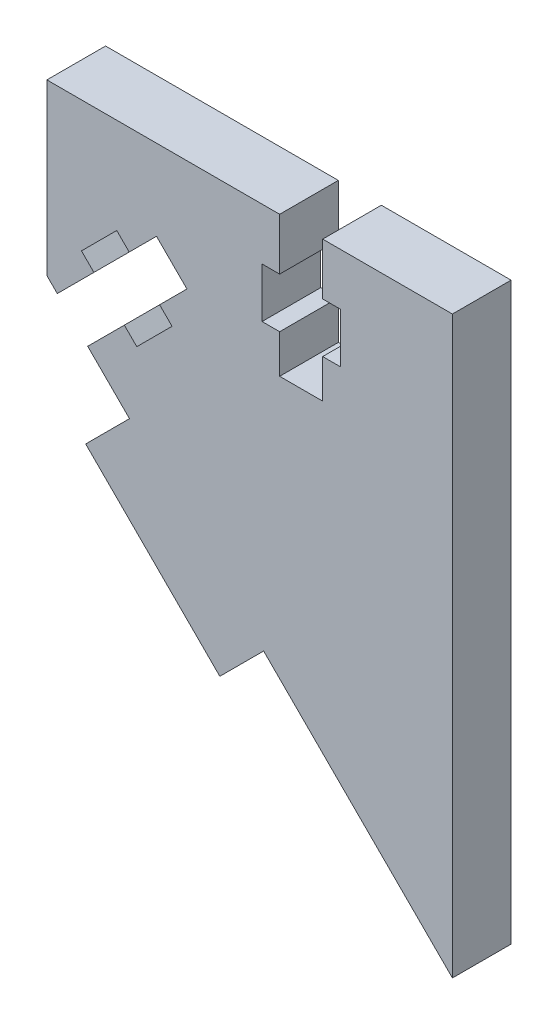
ISO-10303-21;
HEADER;
FILE_DESCRIPTION(('STEP AP214'),'2;1');
FILE_NAME('part.step','',(''),(''),'','','');
FILE_SCHEMA(('AUTOMOTIVE_DESIGN { 1 0 10303 214 1 1 1 1 }'));
ENDSEC;
DATA;
#1=APPLICATION_CONTEXT('core data for automotive mechanical design processes');
#2=APPLICATION_PROTOCOL_DEFINITION('international standard','automotive_design',2000,#1);
#3=PRODUCT_CONTEXT('',#1,'mechanical');
#4=PRODUCT('Part','Part','',(#3));
#5=PRODUCT_RELATED_PRODUCT_CATEGORY('part','',(#4));
#6=PRODUCT_DEFINITION_FORMATION('','',#4);
#7=PRODUCT_DEFINITION_CONTEXT('part definition',#1,'design');
#8=PRODUCT_DEFINITION('design','',#6,#7);
#9=PRODUCT_DEFINITION_SHAPE('','',#8);
#10=(LENGTH_UNIT() NAMED_UNIT(*) SI_UNIT(.MILLI.,.METRE.));
#11=(NAMED_UNIT(*) PLANE_ANGLE_UNIT() SI_UNIT($,.RADIAN.));
#12=(NAMED_UNIT(*) SI_UNIT($,.STERADIAN.) SOLID_ANGLE_UNIT());
#13=UNCERTAINTY_MEASURE_WITH_UNIT(LENGTH_MEASURE(1.E-05),#10,'distance_accuracy_value','');
#14=(GEOMETRIC_REPRESENTATION_CONTEXT(3) GLOBAL_UNCERTAINTY_ASSIGNED_CONTEXT((#13)) GLOBAL_UNIT_ASSIGNED_CONTEXT((#10,
#11,#12)) REPRESENTATION_CONTEXT('',''));
#15=CARTESIAN_POINT('',(0.,0.,0.));
#16=DIRECTION('',(0.,0.,1.));
#17=DIRECTION('',(1.,0.,0.));
#18=AXIS2_PLACEMENT_3D('',#15,#16,#17);
#19=CARTESIAN_POINT('',(37.2899171233436,57.7322805717091,6.));
#20=DIRECTION('',(0.707106781186467,0.707106781186629,0.));
#21=DIRECTION('',(-0.707106781186629,0.707106781186467,0.));
#22=AXIS2_PLACEMENT_3D('',#19,#20,#21);
#23=PLANE('',#22);
#24=DIRECTION('',(0.707106781186628,-0.707106781186467,0.));
#25=VECTOR('',#24,1.);
#26=CARTESIAN_POINT('',(37.2899171233436,57.7322805717091,0.));
#27=LINE('',#26,#25);
#28=CARTESIAN_POINT('',(37.2899171233436,57.7322805717091,0.));
#29=VERTEX_POINT('',#28);
#30=CARTESIAN_POINT('',(38.5627079774212,56.4594897176318,0.));
#31=VERTEX_POINT('',#30);
#32=EDGE_CURVE('E278',#29,#31,#27,.T.);
#33=ORIENTED_EDGE('',*,*,#32,.T.);
#34=DIRECTION('',(0.,0.,-1.));
#35=VECTOR('',#34,1.);
#36=CARTESIAN_POINT('',(38.5627079774212,56.4594897176318,6.));
#37=LINE('',#36,#35);
#38=CARTESIAN_POINT('',(38.5627079774212,56.4594897176318,6.));
#39=VERTEX_POINT('',#38);
#40=EDGE_CURVE('E11',#39,#31,#37,.T.);
#41=ORIENTED_EDGE('',*,*,#40,.F.);
#42=DIRECTION('',(0.707106781186628,-0.707106781186467,0.));
#43=VECTOR('',#42,1.);
#44=CARTESIAN_POINT('',(37.2899171233436,57.7322805717091,6.));
#45=LINE('',#44,#43);
#46=CARTESIAN_POINT('',(37.2899171233436,57.7322805717091,6.));
#47=VERTEX_POINT('',#46);
#48=EDGE_CURVE('E340',#47,#39,#45,.T.);
#49=ORIENTED_EDGE('',*,*,#48,.F.);
#50=DIRECTION('',(0.,0.,-1.));
#51=VECTOR('',#50,1.);
#52=CARTESIAN_POINT('',(37.2899171233436,57.7322805717091,6.));
#53=LINE('',#52,#51);
#54=EDGE_CURVE('E274',#47,#29,#53,.T.);
#55=ORIENTED_EDGE('',*,*,#54,.T.);
#56=EDGE_LOOP('',(#33,#41,#49,#55));
#57=FACE_BOUND('',#56,.T.);
#58=ADVANCED_FACE('F38',(#57),#23,.F.);
#59=CARTESIAN_POINT('',(38.5627079774212,56.4594897176318,6.));
#60=DIRECTION('',(-0.707106781186467,0.707106781186628,0.));
#61=DIRECTION('',(-0.707106781186628,-0.707106781186467,0.));
#62=AXIS2_PLACEMENT_3D('',#59,#60,#61);
#63=PLANE('',#62);
#64=DIRECTION('',(0.707106781186628,0.707106781186467,0.));
#65=VECTOR('',#64,1.);
#66=CARTESIAN_POINT('',(38.5627079774212,56.4594897176318,0.));
#67=LINE('',#66,#65);
#68=CARTESIAN_POINT('',(41.3557794140099,59.2525611542199,0.));
#69=VERTEX_POINT('',#68);
#70=EDGE_CURVE('E281',#31,#69,#67,.T.);
#71=ORIENTED_EDGE('',*,*,#70,.T.);
#72=DIRECTION('',(0.,0.,-1.));
#73=VECTOR('',#72,1.);
#74=CARTESIAN_POINT('',(41.3557794140099,59.2525611542199,6.));
#75=LINE('',#74,#73);
#76=CARTESIAN_POINT('',(41.3557794140099,59.2525611542199,6.));
#77=VERTEX_POINT('',#76);
#78=EDGE_CURVE('E46',#77,#69,#75,.T.);
#79=ORIENTED_EDGE('',*,*,#78,.F.);
#80=DIRECTION('',(0.707106781186628,0.707106781186467,0.));
#81=VECTOR('',#80,1.);
#82=CARTESIAN_POINT('',(38.5627079774212,56.4594897176318,6.));
#83=LINE('',#82,#81);
#84=EDGE_CURVE('E169',#39,#77,#83,.T.);
#85=ORIENTED_EDGE('',*,*,#84,.F.);
#86=ORIENTED_EDGE('',*,*,#40,.T.);
#87=EDGE_LOOP('',(#71,#79,#85,#86));
#88=FACE_BOUND('',#87,.T.);
#89=ADVANCED_FACE('F518',(#88),#63,.F.);
#90=CARTESIAN_POINT('',(41.3557794140099,59.2525611542199,6.));
#91=DIRECTION('',(0.707106781186548,0.707106781186547,0.));
#92=DIRECTION('',(-0.707106781186547,0.707106781186548,0.));
#93=AXIS2_PLACEMENT_3D('',#90,#91,#92);
#94=PLANE('',#93);
#95=DIRECTION('',(0.707106781186547,-0.707106781186548,0.));
#96=VECTOR('',#95,1.);
#97=CARTESIAN_POINT('',(41.3557794140099,59.2525611542199,0.));
#98=LINE('',#97,#96);
#99=CARTESIAN_POINT('',(44.467052305718,56.1412882625117,0.));
#100=VERTEX_POINT('',#99);
#101=EDGE_CURVE('E283',#69,#100,#98,.T.);
#102=ORIENTED_EDGE('',*,*,#101,.T.);
#103=DIRECTION('',(0.,0.,-1.));
#104=VECTOR('',#103,1.);
#105=CARTESIAN_POINT('',(44.467052305718,56.1412882625117,6.));
#106=LINE('',#105,#104);
#107=CARTESIAN_POINT('',(44.467052305718,56.1412882625117,6.));
#108=VERTEX_POINT('',#107);
#109=EDGE_CURVE('E419',#108,#100,#106,.T.);
#110=ORIENTED_EDGE('',*,*,#109,.F.);
#111=DIRECTION('',(0.707106781186547,-0.707106781186548,0.));
#112=VECTOR('',#111,1.);
#113=CARTESIAN_POINT('',(41.3557794140099,59.2525611542199,6.));
#114=LINE('',#113,#112);
#115=EDGE_CURVE('E427',#77,#108,#114,.T.);
#116=ORIENTED_EDGE('',*,*,#115,.F.);
#117=ORIENTED_EDGE('',*,*,#78,.T.);
#118=EDGE_LOOP('',(#102,#110,#116,#117));
#119=FACE_BOUND('',#118,.T.);
#120=ADVANCED_FACE('F425',(#119),#94,.F.);
#121=CARTESIAN_POINT('',(44.467052305718,56.1412882625117,6.));
#122=DIRECTION('',(0.707106781186547,-0.707106781186547,0.));
#123=DIRECTION('',(0.707106781186548,0.707106781186548,0.));
#124=AXIS2_PLACEMENT_3D('',#121,#122,#123);
#125=PLANE('',#124);
#126=DIRECTION('',(-0.707106781186548,-0.707106781186548,0.));
#127=VECTOR('',#126,1.);
#128=CARTESIAN_POINT('',(44.467052305718,56.1412882625117,0.));
#129=LINE('',#128,#127);
#130=CARTESIAN_POINT('',(41.6739808691298,53.3482168259235,0.));
#131=VERTEX_POINT('',#130);
#132=EDGE_CURVE('E285',#100,#131,#129,.T.);
#133=ORIENTED_EDGE('',*,*,#132,.T.);
#134=DIRECTION('',(0.,0.,-1.));
#135=VECTOR('',#134,1.);
#136=CARTESIAN_POINT('',(41.6739808691298,53.3482168259235,6.));
#137=LINE('',#136,#135);
#138=CARTESIAN_POINT('',(41.6739808691298,53.3482168259235,6.));
#139=VERTEX_POINT('',#138);
#140=EDGE_CURVE('E416',#139,#131,#137,.T.);
#141=ORIENTED_EDGE('',*,*,#140,.F.);
#142=DIRECTION('',(-0.707106781186548,-0.707106781186548,0.));
#143=VECTOR('',#142,1.);
#144=CARTESIAN_POINT('',(44.467052305718,56.1412882625117,6.));
#145=LINE('',#144,#143);
#146=EDGE_CURVE('E445',#108,#139,#145,.T.);
#147=ORIENTED_EDGE('',*,*,#146,.F.);
#148=ORIENTED_EDGE('',*,*,#109,.T.);
#149=EDGE_LOOP('',(#133,#141,#147,#148));
#150=FACE_BOUND('',#149,.T.);
#151=ADVANCED_FACE('F436',(#150),#125,.F.);
#152=CARTESIAN_POINT('',(41.6739808691298,53.3482168259235,6.));
#153=DIRECTION('',(0.707106781186615,0.70710678118648,0.));
#154=DIRECTION('',(-0.70710678118648,0.707106781186615,0.));
#155=AXIS2_PLACEMENT_3D('',#152,#153,#154);
#156=PLANE('',#155);
#157=DIRECTION('',(0.70710678118648,-0.707106781186615,0.));
#158=VECTOR('',#157,1.);
#159=CARTESIAN_POINT('',(41.6739808691298,53.3482168259235,0.));
#160=LINE('',#159,#158);
#161=CARTESIAN_POINT('',(42.9467717232073,52.0754259718458,0.));
#162=VERTEX_POINT('',#161);
#163=EDGE_CURVE('E287',#131,#162,#160,.T.);
#164=ORIENTED_EDGE('',*,*,#163,.T.);
#165=DIRECTION('',(0.,0.,-1.));
#166=VECTOR('',#165,1.);
#167=CARTESIAN_POINT('',(42.9467717232073,52.0754259718458,6.));
#168=LINE('',#167,#166);
#169=CARTESIAN_POINT('',(42.9467717232073,52.0754259718458,6.));
#170=VERTEX_POINT('',#169);
#171=EDGE_CURVE('E413',#170,#162,#168,.T.);
#172=ORIENTED_EDGE('',*,*,#171,.F.);
#173=DIRECTION('',(0.70710678118648,-0.707106781186615,0.));
#174=VECTOR('',#173,1.);
#175=CARTESIAN_POINT('',(41.6739808691298,53.3482168259235,6.));
#176=LINE('',#175,#174);
#177=EDGE_CURVE('E442',#139,#170,#176,.T.);
#178=ORIENTED_EDGE('',*,*,#177,.F.);
#179=ORIENTED_EDGE('',*,*,#140,.T.);
#180=EDGE_LOOP('',(#164,#172,#178,#179));
#181=FACE_BOUND('',#180,.T.);
#182=ADVANCED_FACE('F440',(#181),#156,.F.);
#183=CARTESIAN_POINT('',(42.9467717232073,52.0754259718458,6.));
#184=DIRECTION('',(0.707106781186519,-0.707106781186575,0.));
#185=DIRECTION('',(0.707106781186575,0.707106781186519,0.));
#186=AXIS2_PLACEMENT_3D('',#183,#184,#185);
#187=PLANE('',#186);
#188=DIRECTION('',(-0.707106781186575,-0.70710678118652,0.));
#189=VECTOR('',#188,1.);
#190=CARTESIAN_POINT('',(42.9467717232073,52.0754259718458,0.));
#191=LINE('',#190,#189);
#192=CARTESIAN_POINT('',(39.3405290083921,48.4691832570309,0.));
#193=VERTEX_POINT('',#192);
#194=EDGE_CURVE('E289',#162,#193,#191,.T.);
#195=ORIENTED_EDGE('',*,*,#194,.T.);
#196=DIRECTION('',(0.,0.,-1.));
#197=VECTOR('',#196,1.);
#198=CARTESIAN_POINT('',(39.3405290083921,48.4691832570309,6.));
#199=LINE('',#198,#197);
#200=CARTESIAN_POINT('',(39.3405290083921,48.4691832570309,6.));
#201=VERTEX_POINT('',#200);
#202=EDGE_CURVE('E410',#201,#193,#199,.T.);
#203=ORIENTED_EDGE('',*,*,#202,.F.);
#204=DIRECTION('',(-0.707106781186575,-0.70710678118652,0.));
#205=VECTOR('',#204,1.);
#206=CARTESIAN_POINT('',(42.9467717232073,52.0754259718458,6.));
#207=LINE('',#206,#205);
#208=EDGE_CURVE('E444',#170,#201,#207,.T.);
#209=ORIENTED_EDGE('',*,*,#208,.F.);
#210=ORIENTED_EDGE('',*,*,#171,.T.);
#211=EDGE_LOOP('',(#195,#203,#209,#210));
#212=FACE_BOUND('',#211,.T.);
#213=ADVANCED_FACE('F531',(#212),#187,.F.);
#214=CARTESIAN_POINT('',(39.3405290083921,48.4691832570309,6.));
#215=DIRECTION('',(-0.7071067811866,-0.707106781186496,0.));
#216=DIRECTION('',(0.707106781186496,-0.7071067811866,0.));
#217=AXIS2_PLACEMENT_3D('',#214,#215,#216);
#218=PLANE('',#217);
#219=DIRECTION('',(-0.707106781186495,0.7071067811866,0.));
#220=VECTOR('',#219,1.);
#221=CARTESIAN_POINT('',(39.3405290083921,48.4691832570309,0.));
#222=LINE('',#221,#220);
#223=CARTESIAN_POINT('',(38.0677381543152,49.741974111108,0.));
#224=VERTEX_POINT('',#223);
#225=EDGE_CURVE('E291',#193,#224,#222,.T.);
#226=ORIENTED_EDGE('',*,*,#225,.T.);
#227=DIRECTION('',(0.,0.,-1.));
#228=VECTOR('',#227,1.);
#229=CARTESIAN_POINT('',(38.0677381543152,49.741974111108,6.));
#230=LINE('',#229,#228);
#231=CARTESIAN_POINT('',(38.0677381543152,49.741974111108,6.));
#232=VERTEX_POINT('',#231);
#233=EDGE_CURVE('E407',#232,#224,#230,.T.);
#234=ORIENTED_EDGE('',*,*,#233,.F.);
#235=DIRECTION('',(-0.707106781186495,0.7071067811866,0.));
#236=VECTOR('',#235,1.);
#237=CARTESIAN_POINT('',(39.3405290083921,48.4691832570309,6.));
#238=LINE('',#237,#236);
#239=EDGE_CURVE('E447',#201,#232,#238,.T.);
#240=ORIENTED_EDGE('',*,*,#239,.F.);
#241=ORIENTED_EDGE('',*,*,#202,.T.);
#242=EDGE_LOOP('',(#226,#234,#240,#241));
#243=FACE_BOUND('',#242,.T.);
#244=ADVANCED_FACE('F534',(#243),#218,.F.);
#245=CARTESIAN_POINT('',(38.0677381543152,49.741974111108,6.));
#246=DIRECTION('',(0.707106781186469,-0.707106781186626,0.));
#247=DIRECTION('',(0.707106781186626,0.707106781186469,0.));
#248=AXIS2_PLACEMENT_3D('',#245,#246,#247);
#249=PLANE('',#248);
#250=DIRECTION('',(-0.707106781186626,-0.707106781186469,0.));
#251=VECTOR('',#250,1.);
#252=CARTESIAN_POINT('',(38.0677381543152,49.741974111108,0.));
#253=LINE('',#252,#251);
#254=CARTESIAN_POINT('',(34.3200733469527,45.9943093037463,0.));
#255=VERTEX_POINT('',#254);
#256=EDGE_CURVE('E293',#224,#255,#253,.T.);
#257=ORIENTED_EDGE('',*,*,#256,.T.);
#258=DIRECTION('',(0.,0.,-1.));
#259=VECTOR('',#258,1.);
#260=CARTESIAN_POINT('',(34.3200733469527,45.9943093037463,6.));
#261=LINE('',#260,#259);
#262=CARTESIAN_POINT('',(34.3200733469527,45.9943093037463,6.));
#263=VERTEX_POINT('',#262);
#264=EDGE_CURVE('E404',#263,#255,#261,.T.);
#265=ORIENTED_EDGE('',*,*,#264,.F.);
#266=DIRECTION('',(-0.707106781186626,-0.707106781186469,0.));
#267=VECTOR('',#266,1.);
#268=CARTESIAN_POINT('',(38.0677381543152,49.741974111108,6.));
#269=LINE('',#268,#267);
#270=EDGE_CURVE('E453',#232,#263,#269,.T.);
#271=ORIENTED_EDGE('',*,*,#270,.F.);
#272=ORIENTED_EDGE('',*,*,#233,.T.);
#273=EDGE_LOOP('',(#257,#265,#271,#272));
#274=FACE_BOUND('',#273,.T.);
#275=ADVANCED_FACE('F538',(#274),#249,.F.);
#276=CARTESIAN_POINT('',(38.5931592389421,41.721223411756,6.));
#277=DIRECTION('',(0.707106781186616,0.707106781186479,0.));
#278=DIRECTION('',(-0.707106781186479,0.707106781186616,0.));
#279=AXIS2_PLACEMENT_3D('',#276,#277,#278);
#280=PLANE('',#279);
#281=DIRECTION('',(0.707106781186479,-0.707106781186616,0.));
#282=VECTOR('',#281,1.);
#283=CARTESIAN_POINT('',(38.5931592389421,41.721223411756,0.));
#284=LINE('',#283,#282);
#285=CARTESIAN_POINT('',(38.5931592389421,41.721223411756,0.));
#286=VERTEX_POINT('',#285);
#287=EDGE_CURVE('E295',#255,#286,#284,.T.);
#288=ORIENTED_EDGE('',*,*,#287,.T.);
#289=DIRECTION('',(0.,0.,-1.));
#290=VECTOR('',#289,1.);
#291=CARTESIAN_POINT('',(38.5931592389421,41.721223411756,6.));
#292=LINE('',#291,#290);
#293=CARTESIAN_POINT('',(38.5931592389421,41.721223411756,6.));
#294=VERTEX_POINT('',#293);
#295=EDGE_CURVE('E401',#294,#286,#292,.T.);
#296=ORIENTED_EDGE('',*,*,#295,.F.);
#297=DIRECTION('',(0.707106781186479,-0.707106781186616,0.));
#298=VECTOR('',#297,1.);
#299=CARTESIAN_POINT('',(38.5931592389421,41.721223411756,6.));
#300=LINE('',#299,#298);
#301=EDGE_CURVE('E455',#263,#294,#300,.T.);
#302=ORIENTED_EDGE('',*,*,#301,.F.);
#303=ORIENTED_EDGE('',*,*,#264,.T.);
#304=EDGE_LOOP('',(#288,#296,#302,#303));
#305=FACE_BOUND('',#304,.T.);
#306=ADVANCED_FACE('F542',(#305),#280,.F.);
#307=CARTESIAN_POINT('',(38.5931592389421,41.721223411756,6.));
#308=DIRECTION('',(0.707106781186554,-0.707106781186541,0.));
#309=DIRECTION('',(0.707106781186541,0.707106781186554,0.));
#310=AXIS2_PLACEMENT_3D('',#307,#308,#309);
#311=PLANE('',#310);
#312=DIRECTION('',(-0.707106781186541,-0.707106781186554,0.));
#313=VECTOR('',#312,1.);
#314=CARTESIAN_POINT('',(38.5931592389421,41.721223411756,0.));
#315=LINE('',#314,#313);
#316=CARTESIAN_POINT('',(34.1127995526525,37.2408637254663,0.));
#317=VERTEX_POINT('',#316);
#318=EDGE_CURVE('E297',#286,#317,#315,.T.);
#319=ORIENTED_EDGE('',*,*,#318,.T.);
#320=DIRECTION('',(0.,0.,-1.));
#321=VECTOR('',#320,1.);
#322=CARTESIAN_POINT('',(34.1127995526525,37.2408637254663,6.));
#323=LINE('',#322,#321);
#324=CARTESIAN_POINT('',(34.1127995526525,37.2408637254663,6.));
#325=VERTEX_POINT('',#324);
#326=EDGE_CURVE('E398',#325,#317,#323,.T.);
#327=ORIENTED_EDGE('',*,*,#326,.F.);
#328=DIRECTION('',(-0.707106781186541,-0.707106781186554,0.));
#329=VECTOR('',#328,1.);
#330=CARTESIAN_POINT('',(38.5931592389421,41.721223411756,6.));
#331=LINE('',#330,#329);
#332=EDGE_CURVE('E457',#294,#325,#331,.T.);
#333=ORIENTED_EDGE('',*,*,#332,.F.);
#334=ORIENTED_EDGE('',*,*,#295,.T.);
#335=EDGE_LOOP('',(#319,#327,#333,#334));
#336=FACE_BOUND('',#335,.T.);
#337=ADVANCED_FACE('F546',(#336),#311,.F.);
#338=CARTESIAN_POINT('',(34.1127995526525,37.2408637254663,6.));
#339=DIRECTION('',(0.707106781186563,0.707106781186532,0.));
#340=DIRECTION('',(-0.707106781186532,0.707106781186563,0.));
#341=AXIS2_PLACEMENT_3D('',#338,#339,#340);
#342=PLANE('',#341);
#343=DIRECTION('',(0.707106781186532,-0.707106781186563,0.));
#344=VECTOR('',#343,1.);
#345=CARTESIAN_POINT('',(34.1127995526525,37.2408637254663,0.));
#346=LINE('',#345,#344);
#347=CARTESIAN_POINT('',(47.8306670666276,23.5229962114907,0.));
#348=VERTEX_POINT('',#347);
#349=EDGE_CURVE('E299',#317,#348,#346,.T.);
#350=ORIENTED_EDGE('',*,*,#349,.T.);
#351=DIRECTION('',(0.,0.,-1.));
#352=VECTOR('',#351,1.);
#353=CARTESIAN_POINT('',(47.8306670666276,23.5229962114907,6.));
#354=LINE('',#353,#352);
#355=CARTESIAN_POINT('',(47.8306670666276,23.5229962114907,6.));
#356=VERTEX_POINT('',#355);
#357=EDGE_CURVE('E395',#356,#348,#354,.T.);
#358=ORIENTED_EDGE('',*,*,#357,.F.);
#359=DIRECTION('',(0.707106781186532,-0.707106781186563,0.));
#360=VECTOR('',#359,1.);
#361=CARTESIAN_POINT('',(34.1127995526525,37.2408637254663,6.));
#362=LINE('',#361,#360);
#363=EDGE_CURVE('E459',#325,#356,#362,.T.);
#364=ORIENTED_EDGE('',*,*,#363,.F.);
#365=ORIENTED_EDGE('',*,*,#326,.T.);
#366=EDGE_LOOP('',(#350,#358,#364,#365));
#367=FACE_BOUND('',#366,.T.);
#368=ADVANCED_FACE('F550',(#367),#342,.F.);
#369=CARTESIAN_POINT('',(47.8306670666276,23.5229962114907,6.));
#370=DIRECTION('',(-0.707106781186588,0.707106781186507,0.));
#371=DIRECTION('',(-0.707106781186507,-0.707106781186588,0.));
#372=AXIS2_PLACEMENT_3D('',#369,#370,#371);
#373=PLANE('',#372);
#374=DIRECTION('',(0.707106781186507,0.707106781186588,0.));
#375=VECTOR('',#374,1.);
#376=CARTESIAN_POINT('',(47.8306670666276,23.5229962114907,0.));
#377=LINE('',#376,#375);
#378=CARTESIAN_POINT('',(52.3110267529176,28.0033558977812,0.));
#379=VERTEX_POINT('',#378);
#380=EDGE_CURVE('E301',#348,#379,#377,.T.);
#381=ORIENTED_EDGE('',*,*,#380,.T.);
#382=DIRECTION('',(0.,0.,-1.));
#383=VECTOR('',#382,1.);
#384=CARTESIAN_POINT('',(52.3110267529176,28.0033558977812,6.));
#385=LINE('',#384,#383);
#386=CARTESIAN_POINT('',(52.3110267529176,28.0033558977812,6.));
#387=VERTEX_POINT('',#386);
#388=EDGE_CURVE('E392',#387,#379,#385,.T.);
#389=ORIENTED_EDGE('',*,*,#388,.F.);
#390=DIRECTION('',(0.707106781186507,0.707106781186588,0.));
#391=VECTOR('',#390,1.);
#392=CARTESIAN_POINT('',(47.8306670666276,23.5229962114907,6.));
#393=LINE('',#392,#391);
#394=EDGE_CURVE('E461',#356,#387,#393,.T.);
#395=ORIENTED_EDGE('',*,*,#394,.F.);
#396=ORIENTED_EDGE('',*,*,#357,.T.);
#397=EDGE_LOOP('',(#381,#389,#395,#396));
#398=FACE_BOUND('',#397,.T.);
#399=ADVANCED_FACE('F554',(#398),#373,.F.);
#400=CARTESIAN_POINT('',(71.6150418067965,8.69934084390166,6.));
#401=DIRECTION('',(0.70710678118656,0.707106781186535,0.));
#402=DIRECTION('',(-0.707106781186535,0.70710678118656,0.));
#403=AXIS2_PLACEMENT_3D('',#400,#401,#402);
#404=PLANE('',#403);
#405=DIRECTION('',(0.707106781186535,-0.70710678118656,0.));
#406=VECTOR('',#405,1.);
#407=CARTESIAN_POINT('',(71.6150418067965,8.69934084390166,0.));
#408=LINE('',#407,#406);
#409=CARTESIAN_POINT('',(71.6150418067965,8.69934084390166,0.));
#410=VERTEX_POINT('',#409);
#411=EDGE_CURVE('E303',#379,#410,#408,.T.);
#412=ORIENTED_EDGE('',*,*,#411,.T.);
#413=DIRECTION('',(0.,0.,-1.));
#414=VECTOR('',#413,1.);
#415=CARTESIAN_POINT('',(71.6150418067965,8.69934084390166,6.));
#416=LINE('',#415,#414);
#417=CARTESIAN_POINT('',(71.6150418067965,8.69934084390166,6.));
#418=VERTEX_POINT('',#417);
#419=EDGE_CURVE('E389',#418,#410,#416,.T.);
#420=ORIENTED_EDGE('',*,*,#419,.F.);
#421=DIRECTION('',(0.707106781186535,-0.70710678118656,0.));
#422=VECTOR('',#421,1.);
#423=CARTESIAN_POINT('',(71.6150418067965,8.69934084390166,6.));
#424=LINE('',#423,#422);
#425=EDGE_CURVE('E463',#387,#418,#424,.T.);
#426=ORIENTED_EDGE('',*,*,#425,.F.);
#427=ORIENTED_EDGE('',*,*,#388,.T.);
#428=EDGE_LOOP('',(#412,#420,#426,#427));
#429=FACE_BOUND('',#428,.T.);
#430=ADVANCED_FACE('F558',(#429),#404,.F.);
#431=CARTESIAN_POINT('',(71.6150418067964,67.499336139902,6.));
#432=DIRECTION('',(-1.,0.,0.));
#433=DIRECTION('',(0.,-1.,0.));
#434=AXIS2_PLACEMENT_3D('',#431,#432,#433);
#435=PLANE('',#434);
#436=DIRECTION('',(0.,1.,0.));
#437=VECTOR('',#436,1.);
#438=CARTESIAN_POINT('',(71.6150418067964,67.499336139902,0.));
#439=LINE('',#438,#437);
#440=CARTESIAN_POINT('',(71.6150418067964,67.499336139902,0.));
#441=VERTEX_POINT('',#440);
#442=EDGE_CURVE('E305',#410,#441,#439,.T.);
#443=ORIENTED_EDGE('',*,*,#442,.T.);
#444=DIRECTION('',(0.,0.,-1.));
#445=VECTOR('',#444,1.);
#446=CARTESIAN_POINT('',(71.6150418067964,67.499336139902,6.));
#447=LINE('',#446,#445);
#448=CARTESIAN_POINT('',(71.6150418067964,67.499336139902,6.));
#449=VERTEX_POINT('',#448);
#450=EDGE_CURVE('E386',#449,#441,#447,.T.);
#451=ORIENTED_EDGE('',*,*,#450,.F.);
#452=DIRECTION('',(0.,1.,0.));
#453=VECTOR('',#452,1.);
#454=CARTESIAN_POINT('',(71.6150418067964,67.499336139902,6.));
#455=LINE('',#454,#453);
#456=EDGE_CURVE('E465',#418,#449,#455,.T.);
#457=ORIENTED_EDGE('',*,*,#456,.F.);
#458=ORIENTED_EDGE('',*,*,#419,.T.);
#459=EDGE_LOOP('',(#443,#451,#457,#458));
#460=FACE_BOUND('',#459,.T.);
#461=ADVANCED_FACE('F562',(#460),#435,.F.);
#462=CARTESIAN_POINT('',(71.6150418067964,67.499336139902,6.));
#463=DIRECTION('',(-3.23228183936215E-13,-1.,0.));
#464=DIRECTION('',(1.,-3.23228183936215E-13,0.));
#465=AXIS2_PLACEMENT_3D('',#462,#463,#464);
#466=PLANE('',#465);
#467=DIRECTION('',(-1.,3.23228183936215E-13,0.));
#468=VECTOR('',#467,1.);
#469=CARTESIAN_POINT('',(71.6150418067964,67.499336139902,0.));
#470=LINE('',#469,#468);
#471=CARTESIAN_POINT('',(58.3481404481547,67.4993361399063,0.));
#472=VERTEX_POINT('',#471);
#473=EDGE_CURVE('E307',#441,#472,#470,.T.);
#474=ORIENTED_EDGE('',*,*,#473,.T.);
#475=DIRECTION('',(0.,0.,-1.));
#476=VECTOR('',#475,1.);
#477=CARTESIAN_POINT('',(58.3481404481547,67.4993361399063,6.));
#478=LINE('',#477,#476);
#479=CARTESIAN_POINT('',(58.3481404481547,67.4993361399063,6.));
#480=VERTEX_POINT('',#479);
#481=EDGE_CURVE('E383',#480,#472,#478,.T.);
#482=ORIENTED_EDGE('',*,*,#481,.F.);
#483=DIRECTION('',(-1.,3.23228183936215E-13,0.));
#484=VECTOR('',#483,1.);
#485=CARTESIAN_POINT('',(71.6150418067964,67.499336139902,6.));
#486=LINE('',#485,#484);
#487=EDGE_CURVE('E467',#449,#480,#486,.T.);
#488=ORIENTED_EDGE('',*,*,#487,.F.);
#489=ORIENTED_EDGE('',*,*,#450,.T.);
#490=EDGE_LOOP('',(#474,#482,#488,#489));
#491=FACE_BOUND('',#490,.T.);
#492=ADVANCED_FACE('F566',(#491),#466,.F.);
#493=CARTESIAN_POINT('',(58.3481404481547,67.4993361399063,6.));
#494=DIRECTION('',(1.,8.11719909615041E-13,0.));
#495=DIRECTION('',(-8.11719909615041E-13,1.,0.));
#496=AXIS2_PLACEMENT_3D('',#493,#494,#495);
#497=PLANE('',#496);
#498=DIRECTION('',(8.11719909615041E-13,-1.,0.));
#499=VECTOR('',#498,1.);
#500=CARTESIAN_POINT('',(58.3481404481547,67.4993361399063,0.));
#501=LINE('',#500,#499);
#502=CARTESIAN_POINT('',(58.348140448159,62.1993377421058,0.));
#503=VERTEX_POINT('',#502);
#504=EDGE_CURVE('E309',#472,#503,#501,.T.);
#505=ORIENTED_EDGE('',*,*,#504,.T.);
#506=DIRECTION('',(0.,0.,-1.));
#507=VECTOR('',#506,1.);
#508=CARTESIAN_POINT('',(58.348140448159,62.1993377421058,6.));
#509=LINE('',#508,#507);
#510=CARTESIAN_POINT('',(58.348140448159,62.1993377421058,6.));
#511=VERTEX_POINT('',#510);
#512=EDGE_CURVE('E380',#511,#503,#509,.T.);
#513=ORIENTED_EDGE('',*,*,#512,.F.);
#514=DIRECTION('',(8.11719909615041E-13,-1.,0.));
#515=VECTOR('',#514,1.);
#516=CARTESIAN_POINT('',(58.3481404481547,67.4993361399063,6.));
#517=LINE('',#516,#515);
#518=EDGE_CURVE('E469',#480,#511,#517,.T.);
#519=ORIENTED_EDGE('',*,*,#518,.F.);
#520=ORIENTED_EDGE('',*,*,#481,.T.);
#521=EDGE_LOOP('',(#505,#513,#519,#520));
#522=FACE_BOUND('',#521,.T.);
#523=ADVANCED_FACE('F570',(#522),#497,.F.);
#524=CARTESIAN_POINT('',(58.348140448159,62.1993377421058,6.));
#525=DIRECTION('',(-5.97516498675732E-13,1.,0.));
#526=DIRECTION('',(-1.,-5.97516498675732E-13,0.));
#527=AXIS2_PLACEMENT_3D('',#524,#525,#526);
#528=PLANE('',#527);
#529=DIRECTION('',(1.,5.97516498675732E-13,0.));
#530=VECTOR('',#529,1.);
#531=CARTESIAN_POINT('',(58.348140448159,62.1993377421058,0.));
#532=LINE('',#531,#530);
#533=CARTESIAN_POINT('',(60.14813853606,62.1993377421069,0.));
#534=VERTEX_POINT('',#533);
#535=EDGE_CURVE('E311',#503,#534,#532,.T.);
#536=ORIENTED_EDGE('',*,*,#535,.T.);
#537=DIRECTION('',(0.,0.,-1.));
#538=VECTOR('',#537,1.);
#539=CARTESIAN_POINT('',(60.14813853606,62.1993377421069,6.));
#540=LINE('',#539,#538);
#541=CARTESIAN_POINT('',(60.14813853606,62.1993377421069,6.));
#542=VERTEX_POINT('',#541);
#543=EDGE_CURVE('E377',#542,#534,#540,.T.);
#544=ORIENTED_EDGE('',*,*,#543,.F.);
#545=DIRECTION('',(1.,5.97516498675732E-13,0.));
#546=VECTOR('',#545,1.);
#547=CARTESIAN_POINT('',(58.348140448159,62.1993377421058,6.));
#548=LINE('',#547,#546);
#549=EDGE_CURVE('E471',#511,#542,#548,.T.);
#550=ORIENTED_EDGE('',*,*,#549,.F.);
#551=ORIENTED_EDGE('',*,*,#512,.T.);
#552=EDGE_LOOP('',(#536,#544,#550,#551));
#553=FACE_BOUND('',#552,.T.);
#554=ADVANCED_FACE('F574',(#553),#528,.F.);
#555=CARTESIAN_POINT('',(60.14813853606,62.1993377421069,6.));
#556=DIRECTION('',(1.,7.65999861337384E-13,0.));
#557=DIRECTION('',(-7.65999861337384E-13,1.,0.));
#558=AXIS2_PLACEMENT_3D('',#555,#556,#557);
#559=PLANE('',#558);
#560=DIRECTION('',(7.65999861337384E-13,-1.,0.));
#561=VECTOR('',#560,1.);
#562=CARTESIAN_POINT('',(60.14813853606,62.1993377421069,0.));
#563=LINE('',#562,#561);
#564=CARTESIAN_POINT('',(60.1481385360639,57.0993403856072,0.));
#565=VERTEX_POINT('',#564);
#566=EDGE_CURVE('E313',#534,#565,#563,.T.);
#567=ORIENTED_EDGE('',*,*,#566,.T.);
#568=DIRECTION('',(0.,0.,-1.));
#569=VECTOR('',#568,1.);
#570=CARTESIAN_POINT('',(60.1481385360639,57.0993403856072,6.));
#571=LINE('',#570,#569);
#572=CARTESIAN_POINT('',(60.1481385360639,57.0993403856072,6.));
#573=VERTEX_POINT('',#572);
#574=EDGE_CURVE('E374',#573,#565,#571,.T.);
#575=ORIENTED_EDGE('',*,*,#574,.F.);
#576=DIRECTION('',(7.65999861337384E-13,-1.,0.));
#577=VECTOR('',#576,1.);
#578=CARTESIAN_POINT('',(60.14813853606,62.1993377421069,6.));
#579=LINE('',#578,#577);
#580=EDGE_CURVE('E473',#542,#573,#579,.T.);
#581=ORIENTED_EDGE('',*,*,#580,.F.);
#582=ORIENTED_EDGE('',*,*,#543,.T.);
#583=EDGE_LOOP('',(#567,#575,#581,#582));
#584=FACE_BOUND('',#583,.T.);
#585=ADVANCED_FACE('F578',(#584),#559,.F.);
#586=CARTESIAN_POINT('',(60.1481385360639,57.0993403856072,6.));
#587=DIRECTION('',(9.67591233339568E-13,-1.,0.));
#588=DIRECTION('',(1.,9.67591233339568E-13,0.));
#589=AXIS2_PLACEMENT_3D('',#586,#587,#588);
#590=PLANE('',#589);
#591=DIRECTION('',(-1.,-9.67591233339568E-13,0.));
#592=VECTOR('',#591,1.);
#593=CARTESIAN_POINT('',(60.1481385360639,57.0993403856072,0.));
#594=LINE('',#593,#592);
#595=CARTESIAN_POINT('',(58.3481404481632,57.0993403856055,0.));
#596=VERTEX_POINT('',#595);
#597=EDGE_CURVE('E315',#565,#596,#594,.T.);
#598=ORIENTED_EDGE('',*,*,#597,.T.);
#599=DIRECTION('',(0.,0.,-1.));
#600=VECTOR('',#599,1.);
#601=CARTESIAN_POINT('',(58.3481404481632,57.0993403856055,6.));
#602=LINE('',#601,#600);
#603=CARTESIAN_POINT('',(58.3481404481632,57.0993403856055,6.));
#604=VERTEX_POINT('',#603);
#605=EDGE_CURVE('E371',#604,#596,#602,.T.);
#606=ORIENTED_EDGE('',*,*,#605,.F.);
#607=DIRECTION('',(-1.,-9.67591233339568E-13,0.));
#608=VECTOR('',#607,1.);
#609=CARTESIAN_POINT('',(60.1481385360639,57.0993403856072,6.));
#610=LINE('',#609,#608);
#611=EDGE_CURVE('E475',#573,#604,#610,.T.);
#612=ORIENTED_EDGE('',*,*,#611,.F.);
#613=ORIENTED_EDGE('',*,*,#574,.T.);
#614=EDGE_LOOP('',(#598,#606,#612,#613));
#615=FACE_BOUND('',#614,.T.);
#616=ADVANCED_FACE('F582',(#615),#590,.F.);
#617=CARTESIAN_POINT('',(58.3481404481632,57.0993403856055,6.));
#618=DIRECTION('',(1.,7.37806532631935E-13,0.));
#619=DIRECTION('',(-7.37806532631935E-13,1.,0.));
#620=AXIS2_PLACEMENT_3D('',#617,#618,#619);
#621=PLANE('',#620);
#622=DIRECTION('',(7.37806532631935E-13,-1.,0.));
#623=VECTOR('',#622,1.);
#624=CARTESIAN_POINT('',(58.3481404481632,57.0993403856055,0.));
#625=LINE('',#624,#623);
#626=CARTESIAN_POINT('',(58.3481404481661,53.1493408793055,0.));
#627=VERTEX_POINT('',#626);
#628=EDGE_CURVE('E317',#596,#627,#625,.T.);
#629=ORIENTED_EDGE('',*,*,#628,.T.);
#630=DIRECTION('',(0.,0.,-1.));
#631=VECTOR('',#630,1.);
#632=CARTESIAN_POINT('',(58.3481404481661,53.1493408793055,6.));
#633=LINE('',#632,#631);
#634=CARTESIAN_POINT('',(58.3481404481661,53.1493408793055,6.));
#635=VERTEX_POINT('',#634);
#636=EDGE_CURVE('E368',#635,#627,#633,.T.);
#637=ORIENTED_EDGE('',*,*,#636,.F.);
#638=DIRECTION('',(7.37806532631935E-13,-1.,0.));
#639=VECTOR('',#638,1.);
#640=CARTESIAN_POINT('',(58.3481404481632,57.0993403856055,6.));
#641=LINE('',#640,#639);
#642=EDGE_CURVE('E477',#604,#635,#641,.T.);
#643=ORIENTED_EDGE('',*,*,#642,.F.);
#644=ORIENTED_EDGE('',*,*,#605,.T.);
#645=EDGE_LOOP('',(#629,#637,#643,#644));
#646=FACE_BOUND('',#645,.T.);
#647=ADVANCED_FACE('F586',(#646),#621,.F.);
#648=CARTESIAN_POINT('',(58.3481404481661,53.1493408793055,6.));
#649=DIRECTION('',(8.5947578748955E-13,-1.,0.));
#650=DIRECTION('',(1.,8.5947578748955E-13,0.));
#651=AXIS2_PLACEMENT_3D('',#648,#649,#650);
#652=PLANE('',#651);
#653=DIRECTION('',(-1.,-8.5947578748955E-13,0.));
#654=VECTOR('',#653,1.);
#655=CARTESIAN_POINT('',(58.3481404481661,53.1493408793055,0.));
#656=LINE('',#655,#654);
#657=CARTESIAN_POINT('',(53.9481361284686,53.1493408793017,0.));
#658=VERTEX_POINT('',#657);
#659=EDGE_CURVE('E319',#627,#658,#656,.T.);
#660=ORIENTED_EDGE('',*,*,#659,.T.);
#661=DIRECTION('',(0.,0.,-1.));
#662=VECTOR('',#661,1.);
#663=CARTESIAN_POINT('',(53.9481361284686,53.1493408793017,6.));
#664=LINE('',#663,#662);
#665=CARTESIAN_POINT('',(53.9481361284686,53.1493408793017,6.));
#666=VERTEX_POINT('',#665);
#667=EDGE_CURVE('E365',#666,#658,#664,.T.);
#668=ORIENTED_EDGE('',*,*,#667,.F.);
#669=DIRECTION('',(-1.,-8.5947578748955E-13,0.));
#670=VECTOR('',#669,1.);
#671=CARTESIAN_POINT('',(58.3481404481661,53.1493408793055,6.));
#672=LINE('',#671,#670);
#673=EDGE_CURVE('E479',#635,#666,#672,.T.);
#674=ORIENTED_EDGE('',*,*,#673,.F.);
#675=ORIENTED_EDGE('',*,*,#636,.T.);
#676=EDGE_LOOP('',(#660,#668,#674,#675));
#677=FACE_BOUND('',#676,.T.);
#678=ADVANCED_FACE('F590',(#677),#652,.F.);
#679=CARTESIAN_POINT('',(53.9481361284686,53.1493408793017,6.));
#680=DIRECTION('',(-1.,-8.36180736982816E-13,0.));
#681=DIRECTION('',(8.36180736982816E-13,-1.,0.));
#682=AXIS2_PLACEMENT_3D('',#679,#680,#681);
#683=PLANE('',#682);
#684=DIRECTION('',(-8.36180736982816E-13,1.,0.));
#685=VECTOR('',#684,1.);
#686=CARTESIAN_POINT('',(53.9481361284686,53.1493408793017,0.));
#687=LINE('',#686,#685);
#688=CARTESIAN_POINT('',(53.9481361284653,57.0993403856019,0.));
#689=VERTEX_POINT('',#688);
#690=EDGE_CURVE('E321',#658,#689,#687,.T.);
#691=ORIENTED_EDGE('',*,*,#690,.T.);
#692=DIRECTION('',(0.,0.,-1.));
#693=VECTOR('',#692,1.);
#694=CARTESIAN_POINT('',(53.9481361284653,57.0993403856019,6.));
#695=LINE('',#694,#693);
#696=CARTESIAN_POINT('',(53.9481361284653,57.0993403856019,6.));
#697=VERTEX_POINT('',#696);
#698=EDGE_CURVE('E362',#697,#689,#695,.T.);
#699=ORIENTED_EDGE('',*,*,#698,.F.);
#700=DIRECTION('',(-8.36180736982816E-13,1.,0.));
#701=VECTOR('',#700,1.);
#702=CARTESIAN_POINT('',(53.9481361284686,53.1493408793017,6.));
#703=LINE('',#702,#701);
#704=EDGE_CURVE('E481',#666,#697,#703,.T.);
#705=ORIENTED_EDGE('',*,*,#704,.F.);
#706=ORIENTED_EDGE('',*,*,#667,.T.);
#707=EDGE_LOOP('',(#691,#699,#705,#706));
#708=FACE_BOUND('',#707,.T.);
#709=ADVANCED_FACE('F594',(#708),#683,.F.);
#710=CARTESIAN_POINT('',(53.9481361284653,57.0993403856019,6.));
#711=DIRECTION('',(7.09309908105309E-13,-1.,0.));
#712=DIRECTION('',(1.,7.09309908105309E-13,0.));
#713=AXIS2_PLACEMENT_3D('',#710,#711,#712);
#714=PLANE('',#713);
#715=DIRECTION('',(-1.,-7.09309908105309E-13,0.));
#716=VECTOR('',#715,1.);
#717=CARTESIAN_POINT('',(53.9481361284653,57.0993403856019,0.));
#718=LINE('',#717,#716);
#719=CARTESIAN_POINT('',(52.1481380405641,57.0993403856006,0.));
#720=VERTEX_POINT('',#719);
#721=EDGE_CURVE('E323',#689,#720,#718,.T.);
#722=ORIENTED_EDGE('',*,*,#721,.T.);
#723=DIRECTION('',(0.,0.,-1.));
#724=VECTOR('',#723,1.);
#725=CARTESIAN_POINT('',(52.1481380405641,57.0993403856006,6.));
#726=LINE('',#725,#724);
#727=CARTESIAN_POINT('',(52.1481380405641,57.0993403856006,6.));
#728=VERTEX_POINT('',#727);
#729=EDGE_CURVE('E359',#728,#720,#726,.T.);
#730=ORIENTED_EDGE('',*,*,#729,.F.);
#731=DIRECTION('',(-1.,-7.09309908105309E-13,0.));
#732=VECTOR('',#731,1.);
#733=CARTESIAN_POINT('',(53.9481361284653,57.0993403856019,6.));
#734=LINE('',#733,#732);
#735=EDGE_CURVE('E483',#697,#728,#734,.T.);
#736=ORIENTED_EDGE('',*,*,#735,.F.);
#737=ORIENTED_EDGE('',*,*,#698,.T.);
#738=EDGE_LOOP('',(#722,#730,#736,#737));
#739=FACE_BOUND('',#738,.T.);
#740=ADVANCED_FACE('F598',(#739),#714,.F.);
#741=CARTESIAN_POINT('',(52.1481380405641,57.0993403856006,6.));
#742=DIRECTION('',(-1.,-6.87086909370011E-13,0.));
#743=DIRECTION('',(6.87086909370011E-13,-1.,0.));
#744=AXIS2_PLACEMENT_3D('',#741,#742,#743);
#745=PLANE('',#744);
#746=DIRECTION('',(-6.87086909370011E-13,1.,0.));
#747=VECTOR('',#746,1.);
#748=CARTESIAN_POINT('',(52.1481380405641,57.0993403856006,0.));
#749=LINE('',#748,#747);
#750=CARTESIAN_POINT('',(52.1481380405606,62.1993377421011,0.));
#751=VERTEX_POINT('',#750);
#752=EDGE_CURVE('E325',#720,#751,#749,.T.);
#753=ORIENTED_EDGE('',*,*,#752,.T.);
#754=DIRECTION('',(0.,0.,-1.));
#755=VECTOR('',#754,1.);
#756=CARTESIAN_POINT('',(52.1481380405606,62.1993377421011,6.));
#757=LINE('',#756,#755);
#758=CARTESIAN_POINT('',(52.1481380405606,62.1993377421011,6.));
#759=VERTEX_POINT('',#758);
#760=EDGE_CURVE('E356',#759,#751,#757,.T.);
#761=ORIENTED_EDGE('',*,*,#760,.F.);
#762=DIRECTION('',(-6.87086909370011E-13,1.,0.));
#763=VECTOR('',#762,1.);
#764=CARTESIAN_POINT('',(52.1481380405641,57.0993403856006,6.));
#765=LINE('',#764,#763);
#766=EDGE_CURVE('E485',#728,#759,#765,.T.);
#767=ORIENTED_EDGE('',*,*,#766,.F.);
#768=ORIENTED_EDGE('',*,*,#729,.T.);
#769=EDGE_LOOP('',(#753,#761,#767,#768));
#770=FACE_BOUND('',#769,.T.);
#771=ADVANCED_FACE('F602',(#770),#745,.F.);
#772=CARTESIAN_POINT('',(52.1481380405606,62.1993377421011,6.));
#773=DIRECTION('',(-8.21103317535171E-13,1.,0.));
#774=DIRECTION('',(-1.,-8.21103317535171E-13,0.));
#775=AXIS2_PLACEMENT_3D('',#772,#773,#774);
#776=PLANE('',#775);
#777=DIRECTION('',(1.,8.21103317535171E-13,0.));
#778=VECTOR('',#777,1.);
#779=CARTESIAN_POINT('',(52.1481380405606,62.1993377421011,0.));
#780=LINE('',#779,#778);
#781=CARTESIAN_POINT('',(53.9481361284613,62.1993377421026,0.));
#782=VERTEX_POINT('',#781);
#783=EDGE_CURVE('E327',#751,#782,#780,.T.);
#784=ORIENTED_EDGE('',*,*,#783,.T.);
#785=DIRECTION('',(0.,0.,-1.));
#786=VECTOR('',#785,1.);
#787=CARTESIAN_POINT('',(53.9481361284613,62.1993377421026,6.));
#788=LINE('',#787,#786);
#789=CARTESIAN_POINT('',(53.9481361284613,62.1993377421026,6.));
#790=VERTEX_POINT('',#789);
#791=EDGE_CURVE('E353',#790,#782,#788,.T.);
#792=ORIENTED_EDGE('',*,*,#791,.F.);
#793=DIRECTION('',(1.,8.21103317535171E-13,0.));
#794=VECTOR('',#793,1.);
#795=CARTESIAN_POINT('',(52.1481380405606,62.1993377421011,6.));
#796=LINE('',#795,#794);
#797=EDGE_CURVE('E487',#759,#790,#796,.T.);
#798=ORIENTED_EDGE('',*,*,#797,.F.);
#799=ORIENTED_EDGE('',*,*,#760,.T.);
#800=EDGE_LOOP('',(#784,#792,#798,#799));
#801=FACE_BOUND('',#800,.T.);
#802=ADVANCED_FACE('F606',(#801),#776,.F.);
#803=CARTESIAN_POINT('',(53.9481361284613,62.1993377421026,6.));
#804=DIRECTION('',(-1.,-7.54113980545639E-13,0.));
#805=DIRECTION('',(7.54113980545639E-13,-1.,0.));
#806=AXIS2_PLACEMENT_3D('',#803,#804,#805);
#807=PLANE('',#806);
#808=DIRECTION('',(-7.54113980545639E-13,1.,0.));
#809=VECTOR('',#808,1.);
#810=CARTESIAN_POINT('',(53.9481361284613,62.1993377421026,0.));
#811=LINE('',#810,#809);
#812=CARTESIAN_POINT('',(53.9481361284573,67.4993361399027,0.));
#813=VERTEX_POINT('',#812);
#814=EDGE_CURVE('E329',#782,#813,#811,.T.);
#815=ORIENTED_EDGE('',*,*,#814,.T.);
#816=DIRECTION('',(0.,0.,-1.));
#817=VECTOR('',#816,1.);
#818=CARTESIAN_POINT('',(53.9481361284573,67.4993361399027,6.));
#819=LINE('',#818,#817);
#820=CARTESIAN_POINT('',(53.9481361284573,67.4993361399027,6.));
#821=VERTEX_POINT('',#820);
#822=EDGE_CURVE('E350',#821,#813,#819,.T.);
#823=ORIENTED_EDGE('',*,*,#822,.F.);
#824=DIRECTION('',(-7.54113980545639E-13,1.,0.));
#825=VECTOR('',#824,1.);
#826=CARTESIAN_POINT('',(53.9481361284613,62.1993377421026,6.));
#827=LINE('',#826,#825);
#828=EDGE_CURVE('E489',#790,#821,#827,.T.);
#829=ORIENTED_EDGE('',*,*,#828,.F.);
#830=ORIENTED_EDGE('',*,*,#791,.T.);
#831=EDGE_LOOP('',(#815,#823,#829,#830));
#832=FACE_BOUND('',#831,.T.);
#833=ADVANCED_FACE('F610',(#832),#807,.F.);
#834=CARTESIAN_POINT('',(53.9481361284573,67.4993361399027,6.));
#835=DIRECTION('',(0.,-1.,0.));
#836=DIRECTION('',(1.,0.,0.));
#837=AXIS2_PLACEMENT_3D('',#834,#835,#836);
#838=PLANE('',#837);
#839=DIRECTION('',(-1.,0.,0.));
#840=VECTOR('',#839,1.);
#841=CARTESIAN_POINT('',(53.9481361284573,67.4993361399027,0.));
#842=LINE('',#841,#840);
#843=CARTESIAN_POINT('',(30.148140368317,67.4993361399023,0.));
#844=VERTEX_POINT('',#843);
#845=EDGE_CURVE('E331',#813,#844,#842,.T.);
#846=ORIENTED_EDGE('',*,*,#845,.T.);
#847=DIRECTION('',(0.,0.,-1.));
#848=VECTOR('',#847,1.);
#849=CARTESIAN_POINT('',(30.148140368317,67.4993361399023,6.));
#850=LINE('',#849,#848);
#851=CARTESIAN_POINT('',(30.148140368317,67.4993361399023,6.));
#852=VERTEX_POINT('',#851);
#853=EDGE_CURVE('E347',#852,#844,#850,.T.);
#854=ORIENTED_EDGE('',*,*,#853,.F.);
#855=DIRECTION('',(-1.,0.,0.));
#856=VECTOR('',#855,1.);
#857=CARTESIAN_POINT('',(53.9481361284573,67.4993361399027,6.));
#858=LINE('',#857,#856);
#859=EDGE_CURVE('E491',#821,#852,#858,.T.);
#860=ORIENTED_EDGE('',*,*,#859,.F.);
#861=ORIENTED_EDGE('',*,*,#822,.T.);
#862=EDGE_LOOP('',(#846,#854,#860,#861));
#863=FACE_BOUND('',#862,.T.);
#864=ADVANCED_FACE('F614',(#863),#838,.F.);
#865=CARTESIAN_POINT('',(30.148140368317,67.4993361399023,6.));
#866=DIRECTION('',(1.,0.,0.));
#867=DIRECTION('',(0.,1.,0.));
#868=AXIS2_PLACEMENT_3D('',#865,#866,#867);
#869=PLANE('',#868);
#870=DIRECTION('',(0.,-1.,0.));
#871=VECTOR('',#870,1.);
#872=CARTESIAN_POINT('',(30.148140368317,67.4993361399023,0.));
#873=LINE('',#872,#871);
#874=CARTESIAN_POINT('',(30.1481403683173,50.1662422823817,0.));
#875=VERTEX_POINT('',#874);
#876=EDGE_CURVE('E333',#844,#875,#873,.T.);
#877=ORIENTED_EDGE('',*,*,#876,.T.);
#878=DIRECTION('',(0.,0.,-1.));
#879=VECTOR('',#878,1.);
#880=CARTESIAN_POINT('',(30.1481403683173,50.1662422823817,6.));
#881=LINE('',#880,#879);
#882=CARTESIAN_POINT('',(30.1481403683173,50.1662422823817,6.));
#883=VERTEX_POINT('',#882);
#884=EDGE_CURVE('E344',#883,#875,#881,.T.);
#885=ORIENTED_EDGE('',*,*,#884,.F.);
#886=DIRECTION('',(0.,-1.,0.));
#887=VECTOR('',#886,1.);
#888=CARTESIAN_POINT('',(30.148140368317,67.4993361399023,6.));
#889=LINE('',#888,#887);
#890=EDGE_CURVE('E493',#852,#883,#889,.T.);
#891=ORIENTED_EDGE('',*,*,#890,.F.);
#892=ORIENTED_EDGE('',*,*,#853,.T.);
#893=EDGE_LOOP('',(#877,#885,#891,#892));
#894=FACE_BOUND('',#893,.T.);
#895=ADVANCED_FACE('F499',(#894),#869,.F.);
#896=CARTESIAN_POINT('',(30.1481403683173,50.1662422823817,6.));
#897=DIRECTION('',(0.707106781186729,0.707106781186366,0.));
#898=DIRECTION('',(-0.707106781186366,0.707106781186729,0.));
#899=AXIS2_PLACEMENT_3D('',#896,#897,#898);
#900=PLANE('',#899);
#901=DIRECTION('',(0.707106781186366,-0.707106781186729,0.));
#902=VECTOR('',#901,1.);
#903=CARTESIAN_POINT('',(30.1481403683173,50.1662422823817,0.));
#904=LINE('',#903,#902);
#905=CARTESIAN_POINT('',(31.208800455244,49.1055821954543,0.));
#906=VERTEX_POINT('',#905);
#907=EDGE_CURVE('E335',#875,#906,#904,.T.);
#908=ORIENTED_EDGE('',*,*,#907,.T.);
#909=DIRECTION('',(0.,0.,-1.));
#910=VECTOR('',#909,1.);
#911=CARTESIAN_POINT('',(31.208800455244,49.1055821954543,6.));
#912=LINE('',#911,#910);
#913=CARTESIAN_POINT('',(31.208800455244,49.1055821954543,6.));
#914=VERTEX_POINT('',#913);
#915=EDGE_CURVE('E269',#914,#906,#912,.T.);
#916=ORIENTED_EDGE('',*,*,#915,.F.);
#917=DIRECTION('',(0.707106781186366,-0.707106781186729,0.));
#918=VECTOR('',#917,1.);
#919=CARTESIAN_POINT('',(30.1481403683173,50.1662422823817,6.));
#920=LINE('',#919,#918);
#921=EDGE_CURVE('E260',#883,#914,#920,.T.);
#922=ORIENTED_EDGE('',*,*,#921,.F.);
#923=ORIENTED_EDGE('',*,*,#884,.T.);
#924=EDGE_LOOP('',(#908,#916,#922,#923));
#925=FACE_BOUND('',#924,.T.);
#926=ADVANCED_FACE('F503',(#925),#900,.F.);
#927=CARTESIAN_POINT('',(31.208800455244,49.1055821954543,6.));
#928=DIRECTION('',(-0.707106781186548,0.707106781186547,0.));
#929=DIRECTION('',(-0.707106781186547,-0.707106781186548,0.));
#930=AXIS2_PLACEMENT_3D('',#927,#928,#929);
#931=PLANE('',#930);
#932=DIRECTION('',(0.707106781186547,0.707106781186548,0.));
#933=VECTOR('',#932,1.);
#934=CARTESIAN_POINT('',(31.208800455244,49.1055821954543,0.));
#935=LINE('',#934,#933);
#936=CARTESIAN_POINT('',(34.9564652626065,52.8532470028167,0.));
#937=VERTEX_POINT('',#936);
#938=EDGE_CURVE('E268',#906,#937,#935,.T.);
#939=ORIENTED_EDGE('',*,*,#938,.T.);
#940=DIRECTION('',(0.,0.,-1.));
#941=VECTOR('',#940,1.);
#942=CARTESIAN_POINT('',(34.9564652626065,52.8532470028167,6.));
#943=LINE('',#942,#941);
#944=CARTESIAN_POINT('',(34.9564652626065,52.8532470028167,6.));
#945=VERTEX_POINT('',#944);
#946=EDGE_CURVE('E265',#945,#937,#943,.T.);
#947=ORIENTED_EDGE('',*,*,#946,.F.);
#948=DIRECTION('',(0.707106781186547,0.707106781186548,0.));
#949=VECTOR('',#948,1.);
#950=CARTESIAN_POINT('',(31.208800455244,49.1055821954543,6.));
#951=LINE('',#950,#949);
#952=EDGE_CURVE('E254',#914,#945,#951,.T.);
#953=ORIENTED_EDGE('',*,*,#952,.F.);
#954=ORIENTED_EDGE('',*,*,#915,.T.);
#955=EDGE_LOOP('',(#939,#947,#953,#954));
#956=FACE_BOUND('',#955,.T.);
#957=ADVANCED_FACE('F266',(#956),#931,.F.);
#958=CARTESIAN_POINT('',(34.9564652626065,52.8532470028167,6.));
#959=DIRECTION('',(-0.707106781186376,-0.707106781186719,0.));
#960=DIRECTION('',(0.707106781186719,-0.707106781186376,0.));
#961=AXIS2_PLACEMENT_3D('',#958,#959,#960);
#962=PLANE('',#961);
#963=DIRECTION('',(-0.707106781186719,0.707106781186376,0.));
#964=VECTOR('',#963,1.);
#965=CARTESIAN_POINT('',(34.9564652626065,52.8532470028167,0.));
#966=LINE('',#965,#964);
#967=CARTESIAN_POINT('',(33.6836744085286,54.126037856894,0.));
#968=VERTEX_POINT('',#967);
#969=EDGE_CURVE('E155',#937,#968,#966,.T.);
#970=ORIENTED_EDGE('',*,*,#969,.T.);
#971=DIRECTION('',(0.,0.,-1.));
#972=VECTOR('',#971,1.);
#973=CARTESIAN_POINT('',(33.6836744085286,54.126037856894,6.));
#974=LINE('',#973,#972);
#975=CARTESIAN_POINT('',(33.6836744085286,54.126037856894,6.));
#976=VERTEX_POINT('',#975);
#977=EDGE_CURVE('E270',#976,#968,#974,.T.);
#978=ORIENTED_EDGE('',*,*,#977,.F.);
#979=DIRECTION('',(-0.707106781186719,0.707106781186376,0.));
#980=VECTOR('',#979,1.);
#981=CARTESIAN_POINT('',(34.9564652626065,52.8532470028167,6.));
#982=LINE('',#981,#980);
#983=EDGE_CURVE('E258',#945,#976,#982,.T.);
#984=ORIENTED_EDGE('',*,*,#983,.F.);
#985=ORIENTED_EDGE('',*,*,#946,.T.);
#986=EDGE_LOOP('',(#970,#978,#984,#985));
#987=FACE_BOUND('',#986,.T.);
#988=ADVANCED_FACE('F272',(#987),#962,.F.);
#989=CARTESIAN_POINT('',(33.6836744085286,54.126037856894,6.));
#990=DIRECTION('',(-0.707106781186559,0.707106781186536,0.));
#991=DIRECTION('',(-0.707106781186536,-0.707106781186559,0.));
#992=AXIS2_PLACEMENT_3D('',#989,#990,#991);
#993=PLANE('',#992);
#994=DIRECTION('',(0.707106781186536,0.707106781186559,0.));
#995=VECTOR('',#994,1.);
#996=CARTESIAN_POINT('',(33.6836744085286,54.126037856894,0.));
#997=LINE('',#996,#995);
#998=EDGE_CURVE('E161',#968,#29,#997,.T.);
#999=ORIENTED_EDGE('',*,*,#998,.T.);
#1000=ORIENTED_EDGE('',*,*,#54,.F.);
#1001=DIRECTION('',(0.707106781186536,0.707106781186559,0.));
#1002=VECTOR('',#1001,1.);
#1003=CARTESIAN_POINT('',(33.6836744085286,54.126037856894,6.));
#1004=LINE('',#1003,#1002);
#1005=EDGE_CURVE('E54',#976,#47,#1004,.T.);
#1006=ORIENTED_EDGE('',*,*,#1005,.F.);
#1007=ORIENTED_EDGE('',*,*,#977,.T.);
#1008=EDGE_LOOP('',(#999,#1000,#1006,#1007));
#1009=FACE_BOUND('',#1008,.T.);
#1010=ADVANCED_FACE('F507',(#1009),#993,.F.);
#1011=CARTESIAN_POINT('',(0.,0.,6.));
#1012=DIRECTION('',(0.,0.,1.));
#1013=DIRECTION('',(1.,0.,0.));
#1014=AXIS2_PLACEMENT_3D('',#1011,#1012,#1013);
#1015=PLANE('',#1014);
#1016=ORIENTED_EDGE('',*,*,#48,.T.);
#1017=ORIENTED_EDGE('',*,*,#84,.T.);
#1018=ORIENTED_EDGE('',*,*,#115,.T.);
#1019=ORIENTED_EDGE('',*,*,#146,.T.);
#1020=ORIENTED_EDGE('',*,*,#177,.T.);
#1021=ORIENTED_EDGE('',*,*,#208,.T.);
#1022=ORIENTED_EDGE('',*,*,#239,.T.);
#1023=ORIENTED_EDGE('',*,*,#270,.T.);
#1024=ORIENTED_EDGE('',*,*,#301,.T.);
#1025=ORIENTED_EDGE('',*,*,#332,.T.);
#1026=ORIENTED_EDGE('',*,*,#363,.T.);
#1027=ORIENTED_EDGE('',*,*,#394,.T.);
#1028=ORIENTED_EDGE('',*,*,#425,.T.);
#1029=ORIENTED_EDGE('',*,*,#456,.T.);
#1030=ORIENTED_EDGE('',*,*,#487,.T.);
#1031=ORIENTED_EDGE('',*,*,#518,.T.);
#1032=ORIENTED_EDGE('',*,*,#549,.T.);
#1033=ORIENTED_EDGE('',*,*,#580,.T.);
#1034=ORIENTED_EDGE('',*,*,#611,.T.);
#1035=ORIENTED_EDGE('',*,*,#642,.T.);
#1036=ORIENTED_EDGE('',*,*,#673,.T.);
#1037=ORIENTED_EDGE('',*,*,#704,.T.);
#1038=ORIENTED_EDGE('',*,*,#735,.T.);
#1039=ORIENTED_EDGE('',*,*,#766,.T.);
#1040=ORIENTED_EDGE('',*,*,#797,.T.);
#1041=ORIENTED_EDGE('',*,*,#828,.T.);
#1042=ORIENTED_EDGE('',*,*,#859,.T.);
#1043=ORIENTED_EDGE('',*,*,#890,.T.);
#1044=ORIENTED_EDGE('',*,*,#921,.T.);
#1045=ORIENTED_EDGE('',*,*,#952,.T.);
#1046=ORIENTED_EDGE('',*,*,#983,.T.);
#1047=ORIENTED_EDGE('',*,*,#1005,.T.);
#1048=EDGE_LOOP('',(#1016,#1017,#1018,#1019,#1020,#1021,#1022,#1023,#1024,#1025,#1026,#1027,
#1028,#1029,#1030,#1031,#1032,#1033,#1034,#1035,#1036,#1037,#1038,#1039,#1040,#1041,#1042,#1043,
#1044,#1045,#1046,#1047));
#1049=FACE_BOUND('',#1048,.T.);
#1050=ADVANCED_FACE('F256',(#1049),#1015,.T.);
#1051=CARTESIAN_POINT('',(0.,0.,0.));
#1052=DIRECTION('',(0.,0.,1.));
#1053=DIRECTION('',(1.,0.,0.));
#1054=AXIS2_PLACEMENT_3D('',#1051,#1052,#1053);
#1055=PLANE('',#1054);
#1056=ORIENTED_EDGE('',*,*,#32,.F.);
#1057=ORIENTED_EDGE('',*,*,#998,.F.);
#1058=ORIENTED_EDGE('',*,*,#969,.F.);
#1059=ORIENTED_EDGE('',*,*,#938,.F.);
#1060=ORIENTED_EDGE('',*,*,#907,.F.);
#1061=ORIENTED_EDGE('',*,*,#876,.F.);
#1062=ORIENTED_EDGE('',*,*,#845,.F.);
#1063=ORIENTED_EDGE('',*,*,#814,.F.);
#1064=ORIENTED_EDGE('',*,*,#783,.F.);
#1065=ORIENTED_EDGE('',*,*,#752,.F.);
#1066=ORIENTED_EDGE('',*,*,#721,.F.);
#1067=ORIENTED_EDGE('',*,*,#690,.F.);
#1068=ORIENTED_EDGE('',*,*,#659,.F.);
#1069=ORIENTED_EDGE('',*,*,#628,.F.);
#1070=ORIENTED_EDGE('',*,*,#597,.F.);
#1071=ORIENTED_EDGE('',*,*,#566,.F.);
#1072=ORIENTED_EDGE('',*,*,#535,.F.);
#1073=ORIENTED_EDGE('',*,*,#504,.F.);
#1074=ORIENTED_EDGE('',*,*,#473,.F.);
#1075=ORIENTED_EDGE('',*,*,#442,.F.);
#1076=ORIENTED_EDGE('',*,*,#411,.F.);
#1077=ORIENTED_EDGE('',*,*,#380,.F.);
#1078=ORIENTED_EDGE('',*,*,#349,.F.);
#1079=ORIENTED_EDGE('',*,*,#318,.F.);
#1080=ORIENTED_EDGE('',*,*,#287,.F.);
#1081=ORIENTED_EDGE('',*,*,#256,.F.);
#1082=ORIENTED_EDGE('',*,*,#225,.F.);
#1083=ORIENTED_EDGE('',*,*,#194,.F.);
#1084=ORIENTED_EDGE('',*,*,#163,.F.);
#1085=ORIENTED_EDGE('',*,*,#132,.F.);
#1086=ORIENTED_EDGE('',*,*,#101,.F.);
#1087=ORIENTED_EDGE('',*,*,#70,.F.);
#1088=EDGE_LOOP('',(#1056,#1057,#1058,#1059,#1060,#1061,#1062,#1063,#1064,#1065,#1066,#1067,
#1068,#1069,#1070,#1071,#1072,#1073,#1074,#1075,#1076,#1077,#1078,#1079,#1080,#1081,#1082,#1083,
#1084,#1085,#1086,#1087));
#1089=FACE_BOUND('',#1088,.T.);
#1090=ADVANCED_FACE('F431',(#1089),#1055,.F.);
#1091=CLOSED_SHELL('',(#58,#89,#120,#151,#182,#213,#244,#275,#306,#337,#368,#399,#430,#461,#492,
#523,#554,#585,#616,#647,#678,#709,#740,#771,#802,#833,#864,#895,#926,#957,#988,#1010,#1050,#1090));
#1092=MANIFOLD_SOLID_BREP('B2',#1091);
#1093=ADVANCED_BREP_SHAPE_REPRESENTATION('',(#18,#1092),#14);
#1094=SHAPE_DEFINITION_REPRESENTATION(#9,#1093);
ENDSEC;
END-ISO-10303-21;
